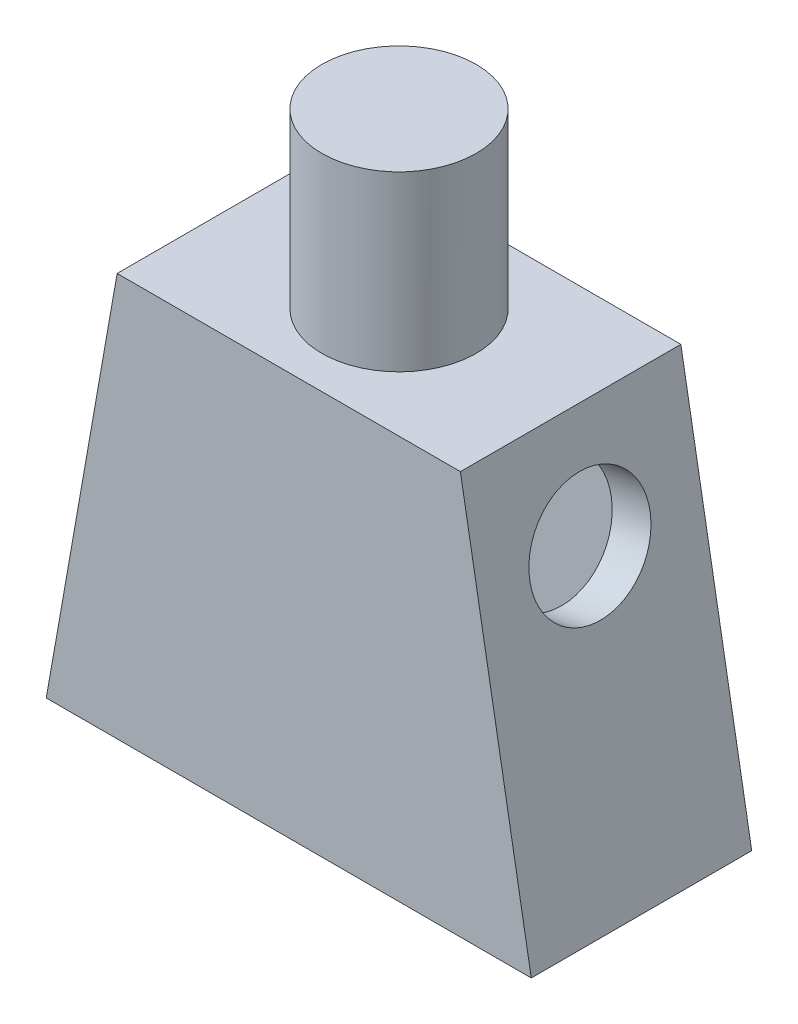
ISO-10303-21;
HEADER;
FILE_DESCRIPTION(('STEP AP214'),'2;1');
FILE_NAME('part.step','',(''),(''),'','','');
FILE_SCHEMA(('AUTOMOTIVE_DESIGN { 1 0 10303 214 1 1 1 1 }'));
ENDSEC;
DATA;
#1=APPLICATION_CONTEXT('core data for automotive mechanical design processes');
#2=APPLICATION_PROTOCOL_DEFINITION('international standard','automotive_design',2000,#1);
#3=PRODUCT_CONTEXT('',#1,'mechanical');
#4=PRODUCT('Part','Part','',(#3));
#5=PRODUCT_RELATED_PRODUCT_CATEGORY('part','',(#4));
#6=PRODUCT_DEFINITION_FORMATION('','',#4);
#7=PRODUCT_DEFINITION_CONTEXT('part definition',#1,'design');
#8=PRODUCT_DEFINITION('design','',#6,#7);
#9=PRODUCT_DEFINITION_SHAPE('','',#8);
#10=(LENGTH_UNIT() NAMED_UNIT(*) SI_UNIT(.MILLI.,.METRE.));
#11=(NAMED_UNIT(*) PLANE_ANGLE_UNIT() SI_UNIT($,.RADIAN.));
#12=(NAMED_UNIT(*) SI_UNIT($,.STERADIAN.) SOLID_ANGLE_UNIT());
#13=UNCERTAINTY_MEASURE_WITH_UNIT(LENGTH_MEASURE(1.E-05),#10,'distance_accuracy_value','');
#14=(GEOMETRIC_REPRESENTATION_CONTEXT(3) GLOBAL_UNCERTAINTY_ASSIGNED_CONTEXT((#13)) GLOBAL_UNIT_ASSIGNED_CONTEXT((#10,
#11,#12)) REPRESENTATION_CONTEXT('',''));
#15=CARTESIAN_POINT('',(0.,0.,0.));
#16=DIRECTION('',(0.,0.,1.));
#17=DIRECTION('',(1.,0.,0.));
#18=AXIS2_PLACEMENT_3D('',#15,#16,#17);
#19=CARTESIAN_POINT('',(5.45,6.4,7.));
#20=DIRECTION('',(0.,-1.,0.));
#21=DIRECTION('',(0.,0.,-1.));
#22=AXIS2_PLACEMENT_3D('',#19,#20,#21);
#23=PLANE('',#22);
#24=DIRECTION('',(-1.,0.,0.));
#25=VECTOR('',#24,1.);
#26=CARTESIAN_POINT('',(5.45,6.4,0.));
#27=LINE('',#26,#25);
#28=CARTESIAN_POINT('',(5.45,6.4,0.));
#29=VERTEX_POINT('',#28);
#30=CARTESIAN_POINT('',(-5.45,6.4,0.));
#31=VERTEX_POINT('',#30);
#32=EDGE_CURVE('E153',#29,#31,#27,.T.);
#33=ORIENTED_EDGE('',*,*,#32,.T.);
#34=DIRECTION('',(0.,0.,-1.));
#35=VECTOR('',#34,1.);
#36=CARTESIAN_POINT('',(-5.45,6.4,7.));
#37=LINE('',#36,#35);
#38=CARTESIAN_POINT('',(-5.45,6.4,7.));
#39=VERTEX_POINT('',#38);
#40=EDGE_CURVE('E161',#39,#31,#37,.T.);
#41=ORIENTED_EDGE('',*,*,#40,.F.);
#42=DIRECTION('',(-1.,0.,0.));
#43=VECTOR('',#42,1.);
#44=CARTESIAN_POINT('',(5.45,6.4,7.));
#45=LINE('',#44,#43);
#46=CARTESIAN_POINT('',(5.45,6.4,7.));
#47=VERTEX_POINT('',#46);
#48=EDGE_CURVE('E84',#47,#39,#45,.T.);
#49=ORIENTED_EDGE('',*,*,#48,.F.);
#50=DIRECTION('',(0.,0.,-1.));
#51=VECTOR('',#50,1.);
#52=CARTESIAN_POINT('',(5.45,6.4,7.));
#53=LINE('',#52,#51);
#54=EDGE_CURVE('E39',#47,#29,#53,.T.);
#55=ORIENTED_EDGE('',*,*,#54,.T.);
#56=EDGE_LOOP('',(#33,#41,#49,#55));
#57=FACE_BOUND('',#56,.T.);
#58=CARTESIAN_POINT('',(0.,6.4,3.5));
#59=DIRECTION('',(0.,-1.,0.));
#60=DIRECTION('',(0.,0.,-1.));
#61=AXIS2_PLACEMENT_3D('',#58,#59,#60);
#62=CIRCLE('',#61,2.45);
#63=CARTESIAN_POINT('',(0.,6.4,1.05));
#64=VERTEX_POINT('',#63);
#65=EDGE_CURVE('E11',#64,#64,#62,.F.);
#66=ORIENTED_EDGE('',*,*,#65,.F.);
#67=EDGE_LOOP('',(#66));
#68=FACE_BOUND('',#67,.T.);
#69=ADVANCED_FACE('F31',(#57,#68),#23,.F.);
#70=CARTESIAN_POINT('',(-7.7,-6.4,7.));
#71=DIRECTION('',(0.,1.,0.));
#72=DIRECTION('',(0.,0.,1.));
#73=AXIS2_PLACEMENT_3D('',#70,#71,#72);
#74=PLANE('',#73);
#75=DIRECTION('',(1.,0.,0.));
#76=VECTOR('',#75,1.);
#77=CARTESIAN_POINT('',(-7.7,-6.4,0.));
#78=LINE('',#77,#76);
#79=CARTESIAN_POINT('',(-7.7,-6.4,0.));
#80=VERTEX_POINT('',#79);
#81=CARTESIAN_POINT('',(7.7,-6.4,0.));
#82=VERTEX_POINT('',#81);
#83=EDGE_CURVE('E76',#80,#82,#78,.T.);
#84=ORIENTED_EDGE('',*,*,#83,.T.);
#85=DIRECTION('',(0.,0.,-1.));
#86=VECTOR('',#85,1.);
#87=CARTESIAN_POINT('',(7.7,-6.4,7.));
#88=LINE('',#87,#86);
#89=CARTESIAN_POINT('',(7.7,-6.4,7.));
#90=VERTEX_POINT('',#89);
#91=EDGE_CURVE('E149',#90,#82,#88,.T.);
#92=ORIENTED_EDGE('',*,*,#91,.F.);
#93=DIRECTION('',(1.,0.,0.));
#94=VECTOR('',#93,1.);
#95=CARTESIAN_POINT('',(-7.7,-6.4,7.));
#96=LINE('',#95,#94);
#97=CARTESIAN_POINT('',(-7.7,-6.4,7.));
#98=VERTEX_POINT('',#97);
#99=EDGE_CURVE('E55',#98,#90,#96,.T.);
#100=ORIENTED_EDGE('',*,*,#99,.F.);
#101=DIRECTION('',(0.,0.,-1.));
#102=VECTOR('',#101,1.);
#103=CARTESIAN_POINT('',(-7.7,-6.4,7.));
#104=LINE('',#103,#102);
#105=EDGE_CURVE('E159',#98,#80,#104,.T.);
#106=ORIENTED_EDGE('',*,*,#105,.T.);
#107=EDGE_LOOP('',(#84,#92,#100,#106));
#108=FACE_BOUND('',#107,.T.);
#109=DIRECTION('',(1.,0.,0.));
#110=VECTOR('',#109,1.);
#111=CARTESIAN_POINT('',(-7.7,-6.4,1.25));
#112=LINE('',#111,#110);
#113=CARTESIAN_POINT('',(-6.43083501377162,-6.4,1.25));
#114=VERTEX_POINT('',#113);
#115=CARTESIAN_POINT('',(6.43083501377163,-6.4,1.25));
#116=VERTEX_POINT('',#115);
#117=EDGE_CURVE('E130',#114,#116,#112,.T.);
#118=ORIENTED_EDGE('',*,*,#117,.F.);
#119=DIRECTION('',(0.,0.,-1.));
#120=VECTOR('',#119,1.);
#121=CARTESIAN_POINT('',(-6.43083501377162,-6.4,7.));
#122=LINE('',#121,#120);
#123=CARTESIAN_POINT('',(-6.43083501377162,-6.4,5.75));
#124=VERTEX_POINT('',#123);
#125=EDGE_CURVE('E125',#124,#114,#122,.T.);
#126=ORIENTED_EDGE('',*,*,#125,.F.);
#127=DIRECTION('',(1.,0.,0.));
#128=VECTOR('',#127,1.);
#129=CARTESIAN_POINT('',(-7.7,-6.4,5.75));
#130=LINE('',#129,#128);
#131=CARTESIAN_POINT('',(6.43083501377163,-6.4,5.75));
#132=VERTEX_POINT('',#131);
#133=EDGE_CURVE('E46',#124,#132,#130,.T.);
#134=ORIENTED_EDGE('',*,*,#133,.T.);
#135=DIRECTION('',(0.,0.,-1.));
#136=VECTOR('',#135,1.);
#137=CARTESIAN_POINT('',(6.43083501377163,-6.4,7.));
#138=LINE('',#137,#136);
#139=EDGE_CURVE('E138',#132,#116,#138,.T.);
#140=ORIENTED_EDGE('',*,*,#139,.T.);
#141=EDGE_LOOP('',(#118,#126,#134,#140));
#142=FACE_BOUND('',#141,.T.);
#143=ADVANCED_FACE('F175',(#108,#142),#74,.F.);
#144=CARTESIAN_POINT('',(7.7,-6.4,7.));
#145=DIRECTION('',(-0.984899531237994,-0.173126870725429,0.));
#146=DIRECTION('',(0.173126870725429,-0.984899531237994,0.));
#147=AXIS2_PLACEMENT_3D('',#144,#145,#146);
#148=PLANE('',#147);
#149=CARTESIAN_POINT('',(6.06286912236802,2.9134556594175,3.5));
#150=DIRECTION('',(0.984899531237994,0.173126870725429,0.));
#151=DIRECTION('',(-0.173126870725429,0.984899531237994,0.));
#152=AXIS2_PLACEMENT_3D('',#149,#150,#151);
#153=CIRCLE('',#152,1.91);
#154=CARTESIAN_POINT('',(5.73219679928245,4.79461376408207,3.5));
#155=VERTEX_POINT('',#154);
#156=EDGE_CURVE('E202',#155,#155,#153,.T.);
#157=ORIENTED_EDGE('',*,*,#156,.F.);
#158=EDGE_LOOP('',(#157));
#159=FACE_BOUND('',#158,.T.);
#160=DIRECTION('',(-0.173126870725429,0.984899531237994,0.));
#161=VECTOR('',#160,1.);
#162=CARTESIAN_POINT('',(7.7,-6.4,0.));
#163=LINE('',#162,#161);
#164=EDGE_CURVE('E150',#82,#29,#163,.T.);
#165=ORIENTED_EDGE('',*,*,#164,.T.);
#166=ORIENTED_EDGE('',*,*,#54,.F.);
#167=DIRECTION('',(-0.173126870725429,0.984899531237994,0.));
#168=VECTOR('',#167,1.);
#169=CARTESIAN_POINT('',(7.7,-6.4,7.));
#170=LINE('',#169,#168);
#171=EDGE_CURVE('E143',#90,#47,#170,.T.);
#172=ORIENTED_EDGE('',*,*,#171,.F.);
#173=ORIENTED_EDGE('',*,*,#91,.T.);
#174=EDGE_LOOP('',(#165,#166,#172,#173));
#175=FACE_BOUND('',#174,.T.);
#176=ADVANCED_FACE('F33',(#159,#175),#148,.F.);
#177=CARTESIAN_POINT('',(-5.45,6.4,7.));
#178=DIRECTION('',(0.984899531237994,-0.173126870725428,0.));
#179=DIRECTION('',(0.173126870725428,0.984899531237994,0.));
#180=AXIS2_PLACEMENT_3D('',#177,#178,#179);
#181=PLANE('',#180);
#182=CARTESIAN_POINT('',(-6.06286912236802,2.9134556594175,3.5));
#183=DIRECTION('',(-0.984899531237994,0.173126870725428,0.));
#184=DIRECTION('',(-0.173126870725428,-0.984899531237994,0.));
#185=AXIS2_PLACEMENT_3D('',#182,#183,#184);
#186=CIRCLE('',#185,1.91);
#187=CARTESIAN_POINT('',(-6.39354144545358,1.03229755475293,3.5));
#188=VERTEX_POINT('',#187);
#189=EDGE_CURVE('E208',#188,#188,#186,.T.);
#190=ORIENTED_EDGE('',*,*,#189,.F.);
#191=EDGE_LOOP('',(#190));
#192=FACE_BOUND('',#191,.T.);
#193=DIRECTION('',(-0.173126870725428,-0.984899531237994,0.));
#194=VECTOR('',#193,1.);
#195=CARTESIAN_POINT('',(-5.45,6.4,0.));
#196=LINE('',#195,#194);
#197=EDGE_CURVE('E155',#31,#80,#196,.T.);
#198=ORIENTED_EDGE('',*,*,#197,.T.);
#199=ORIENTED_EDGE('',*,*,#105,.F.);
#200=DIRECTION('',(-0.173126870725428,-0.984899531237994,0.));
#201=VECTOR('',#200,1.);
#202=CARTESIAN_POINT('',(-5.45,6.4,7.));
#203=LINE('',#202,#201);
#204=EDGE_CURVE('E146',#39,#98,#203,.T.);
#205=ORIENTED_EDGE('',*,*,#204,.F.);
#206=ORIENTED_EDGE('',*,*,#40,.T.);
#207=EDGE_LOOP('',(#198,#199,#205,#206));
#208=FACE_BOUND('',#207,.T.);
#209=ADVANCED_FACE('F173',(#192,#208),#181,.F.);
#210=CARTESIAN_POINT('',(5.45,6.4,7.));
#211=DIRECTION('',(0.,0.,1.));
#212=DIRECTION('',(1.,0.,0.));
#213=AXIS2_PLACEMENT_3D('',#210,#211,#212);
#214=PLANE('',#213);
#215=ORIENTED_EDGE('',*,*,#171,.T.);
#216=ORIENTED_EDGE('',*,*,#48,.T.);
#217=ORIENTED_EDGE('',*,*,#204,.T.);
#218=ORIENTED_EDGE('',*,*,#99,.T.);
#219=EDGE_LOOP('',(#215,#216,#217,#218));
#220=FACE_BOUND('',#219,.T.);
#221=ADVANCED_FACE('F177',(#220),#214,.T.);
#222=CARTESIAN_POINT('',(5.45,6.4,0.));
#223=DIRECTION('',(0.,0.,1.));
#224=DIRECTION('',(1.,0.,0.));
#225=AXIS2_PLACEMENT_3D('',#222,#223,#224);
#226=PLANE('',#225);
#227=ORIENTED_EDGE('',*,*,#164,.F.);
#228=ORIENTED_EDGE('',*,*,#83,.F.);
#229=ORIENTED_EDGE('',*,*,#197,.F.);
#230=ORIENTED_EDGE('',*,*,#32,.F.);
#231=EDGE_LOOP('',(#227,#228,#229,#230));
#232=FACE_BOUND('',#231,.T.);
#233=ADVANCED_FACE('F169',(#232),#226,.F.);
#234=CARTESIAN_POINT('',(6.46887558595251,-6.61640858840679,7.));
#235=DIRECTION('',(-0.984899531237994,-0.173126870725429,0.));
#236=DIRECTION('',(0.173126870725429,-0.984899531237994,0.));
#237=AXIS2_PLACEMENT_3D('',#234,#235,#236);
#238=PLANE('',#237);
#239=CARTESIAN_POINT('',(4.83174470832053,2.69704707101071,3.5));
#240=DIRECTION('',(-0.984899531237994,-0.173126870725429,0.));
#241=DIRECTION('',(0.173126870725429,-0.984899531237994,0.));
#242=AXIS2_PLACEMENT_3D('',#239,#240,#241);
#243=CIRCLE('',#242,1.91);
#244=CARTESIAN_POINT('',(5.1624170314061,0.815888966346144,3.5));
#245=VERTEX_POINT('',#244);
#246=EDGE_CURVE('E205',#245,#245,#243,.F.);
#247=ORIENTED_EDGE('',*,*,#246,.T.);
#248=EDGE_LOOP('',(#247));
#249=FACE_BOUND('',#248,.T.);
#250=DIRECTION('',(-0.173126870725429,0.984899531237994,0.));
#251=VECTOR('',#250,1.);
#252=CARTESIAN_POINT('',(6.46887558595251,-6.61640858840679,1.25));
#253=LINE('',#252,#251);
#254=CARTESIAN_POINT('',(4.40056157627163,5.15,1.25));
#255=VERTEX_POINT('',#254);
#256=EDGE_CURVE('E114',#116,#255,#253,.T.);
#257=ORIENTED_EDGE('',*,*,#256,.F.);
#258=ORIENTED_EDGE('',*,*,#139,.F.);
#259=DIRECTION('',(-0.173126870725429,0.984899531237994,0.));
#260=VECTOR('',#259,1.);
#261=CARTESIAN_POINT('',(6.46887558595251,-6.61640858840679,5.75));
#262=LINE('',#261,#260);
#263=CARTESIAN_POINT('',(4.40056157627163,5.15,5.75));
#264=VERTEX_POINT('',#263);
#265=EDGE_CURVE('E132',#132,#264,#262,.T.);
#266=ORIENTED_EDGE('',*,*,#265,.T.);
#267=DIRECTION('',(0.,0.,-1.));
#268=VECTOR('',#267,1.);
#269=CARTESIAN_POINT('',(4.40056157627163,5.15,7.));
#270=LINE('',#269,#268);
#271=EDGE_CURVE('E124',#264,#255,#270,.T.);
#272=ORIENTED_EDGE('',*,*,#271,.T.);
#273=EDGE_LOOP('',(#257,#258,#266,#272));
#274=FACE_BOUND('',#273,.T.);
#275=ADVANCED_FACE('F184',(#249,#274),#238,.T.);
#276=CARTESIAN_POINT('',(5.45,5.15,7.));
#277=DIRECTION('',(0.,-1.,0.));
#278=DIRECTION('',(0.,0.,-1.));
#279=AXIS2_PLACEMENT_3D('',#276,#277,#278);
#280=PLANE('',#279);
#281=DIRECTION('',(-1.,0.,0.));
#282=VECTOR('',#281,1.);
#283=CARTESIAN_POINT('',(5.45,5.15,1.25));
#284=LINE('',#283,#282);
#285=CARTESIAN_POINT('',(-4.40056157627163,5.15,1.25));
#286=VERTEX_POINT('',#285);
#287=EDGE_CURVE('E107',#255,#286,#284,.T.);
#288=ORIENTED_EDGE('',*,*,#287,.F.);
#289=ORIENTED_EDGE('',*,*,#271,.F.);
#290=DIRECTION('',(-1.,0.,0.));
#291=VECTOR('',#290,1.);
#292=CARTESIAN_POINT('',(5.45,5.15,5.75));
#293=LINE('',#292,#291);
#294=CARTESIAN_POINT('',(-4.40056157627163,5.15,5.75));
#295=VERTEX_POINT('',#294);
#296=EDGE_CURVE('E122',#264,#295,#293,.T.);
#297=ORIENTED_EDGE('',*,*,#296,.T.);
#298=DIRECTION('',(0.,0.,-1.));
#299=VECTOR('',#298,1.);
#300=CARTESIAN_POINT('',(-4.40056157627163,5.15,7.));
#301=LINE('',#300,#299);
#302=EDGE_CURVE('E120',#295,#286,#301,.T.);
#303=ORIENTED_EDGE('',*,*,#302,.T.);
#304=EDGE_LOOP('',(#288,#289,#297,#303));
#305=FACE_BOUND('',#304,.T.);
#306=ADVANCED_FACE('F121',(#305),#280,.T.);
#307=CARTESIAN_POINT('',(-4.21887558595251,6.18359141159321,7.));
#308=DIRECTION('',(0.984899531237994,-0.173126870725428,0.));
#309=DIRECTION('',(0.173126870725428,0.984899531237994,0.));
#310=AXIS2_PLACEMENT_3D('',#307,#308,#309);
#311=PLANE('',#310);
#312=CARTESIAN_POINT('',(-4.83174470832052,2.69704707101071,3.5));
#313=DIRECTION('',(0.984899531237994,-0.173126870725428,0.));
#314=DIRECTION('',(0.173126870725428,0.984899531237994,0.));
#315=AXIS2_PLACEMENT_3D('',#312,#313,#314);
#316=CIRCLE('',#315,1.91);
#317=CARTESIAN_POINT('',(-4.50107238523496,4.57820517567528,3.5));
#318=VERTEX_POINT('',#317);
#319=EDGE_CURVE('E204',#318,#318,#316,.F.);
#320=ORIENTED_EDGE('',*,*,#319,.T.);
#321=EDGE_LOOP('',(#320));
#322=FACE_BOUND('',#321,.T.);
#323=DIRECTION('',(-0.173126870725428,-0.984899531237994,0.));
#324=VECTOR('',#323,1.);
#325=CARTESIAN_POINT('',(-4.21887558595251,6.18359141159321,1.25));
#326=LINE('',#325,#324);
#327=EDGE_CURVE('E111',#286,#114,#326,.T.);
#328=ORIENTED_EDGE('',*,*,#327,.F.);
#329=ORIENTED_EDGE('',*,*,#302,.F.);
#330=DIRECTION('',(-0.173126870725428,-0.984899531237994,0.));
#331=VECTOR('',#330,1.);
#332=CARTESIAN_POINT('',(-4.21887558595251,6.18359141159321,5.75));
#333=LINE('',#332,#331);
#334=EDGE_CURVE('E136',#295,#124,#333,.T.);
#335=ORIENTED_EDGE('',*,*,#334,.T.);
#336=ORIENTED_EDGE('',*,*,#125,.T.);
#337=EDGE_LOOP('',(#328,#329,#335,#336));
#338=FACE_BOUND('',#337,.T.);
#339=ADVANCED_FACE('F127',(#322,#338),#311,.T.);
#340=CARTESIAN_POINT('',(5.45,6.4,5.75));
#341=DIRECTION('',(0.,0.,1.));
#342=DIRECTION('',(1.,0.,0.));
#343=AXIS2_PLACEMENT_3D('',#340,#341,#342);
#344=PLANE('',#343);
#345=ORIENTED_EDGE('',*,*,#265,.F.);
#346=ORIENTED_EDGE('',*,*,#133,.F.);
#347=ORIENTED_EDGE('',*,*,#334,.F.);
#348=ORIENTED_EDGE('',*,*,#296,.F.);
#349=EDGE_LOOP('',(#345,#346,#347,#348));
#350=FACE_BOUND('',#349,.T.);
#351=ADVANCED_FACE('F222',(#350),#344,.F.);
#352=CARTESIAN_POINT('',(5.45,6.4,1.25));
#353=DIRECTION('',(0.,0.,1.));
#354=DIRECTION('',(1.,0.,0.));
#355=AXIS2_PLACEMENT_3D('',#352,#353,#354);
#356=PLANE('',#355);
#357=ORIENTED_EDGE('',*,*,#256,.T.);
#358=ORIENTED_EDGE('',*,*,#287,.T.);
#359=ORIENTED_EDGE('',*,*,#327,.T.);
#360=ORIENTED_EDGE('',*,*,#117,.T.);
#361=EDGE_LOOP('',(#357,#358,#359,#360));
#362=FACE_BOUND('',#361,.T.);
#363=ADVANCED_FACE('F109',(#362),#356,.T.);
#364=CARTESIAN_POINT('',(0.,11.9,3.5));
#365=DIRECTION('',(0.,-1.,0.));
#366=DIRECTION('',(0.,0.,-1.));
#367=AXIS2_PLACEMENT_3D('',#364,#365,#366);
#368=CYLINDRICAL_SURFACE('',#367,2.45);
#369=CARTESIAN_POINT('',(0.,11.9,3.5));
#370=DIRECTION('',(0.,1.,0.));
#371=DIRECTION('',(0.,0.,1.));
#372=AXIS2_PLACEMENT_3D('',#369,#370,#371);
#373=CIRCLE('',#372,2.45);
#374=CARTESIAN_POINT('',(0.,11.9,5.95));
#375=VERTEX_POINT('',#374);
#376=EDGE_CURVE('E214',#375,#375,#373,.T.);
#377=ORIENTED_EDGE('',*,*,#376,.F.);
#378=EDGE_LOOP('',(#377));
#379=FACE_BOUND('',#378,.T.);
#380=ORIENTED_EDGE('',*,*,#65,.T.);
#381=EDGE_LOOP('',(#380));
#382=FACE_BOUND('',#381,.T.);
#383=ADVANCED_FACE('F229',(#379,#382),#368,.T.);
#384=CARTESIAN_POINT('',(0.,11.9,3.5));
#385=DIRECTION('',(0.,1.,0.));
#386=DIRECTION('',(0.,0.,1.));
#387=AXIS2_PLACEMENT_3D('',#384,#385,#386);
#388=PLANE('',#387);
#389=ORIENTED_EDGE('',*,*,#376,.T.);
#390=EDGE_LOOP('',(#389));
#391=FACE_BOUND('',#390,.T.);
#392=ADVANCED_FACE('F240',(#391),#388,.T.);
#393=CARTESIAN_POINT('',(8.87668855143788,0.287361537068811,3.5));
#394=DIRECTION('',(-0.984899531237994,0.173126870725428,0.));
#395=DIRECTION('',(-0.173126870725428,-0.984899531237994,0.));
#396=AXIS2_PLACEMENT_3D('',#393,#394,#395);
#397=CYLINDRICAL_SURFACE('',#396,1.91);
#398=ORIENTED_EDGE('',*,*,#319,.F.);
#399=EDGE_LOOP('',(#398));
#400=FACE_BOUND('',#399,.T.);
#401=ORIENTED_EDGE('',*,*,#189,.T.);
#402=EDGE_LOOP('',(#401));
#403=FACE_BOUND('',#402,.T.);
#404=ADVANCED_FACE('F244',(#400,#403),#397,.F.);
#405=CARTESIAN_POINT('',(-8.87668855143788,0.287361537068804,3.5));
#406=DIRECTION('',(0.984899531237994,0.173126870725429,0.));
#407=DIRECTION('',(-0.173126870725429,0.984899531237994,0.));
#408=AXIS2_PLACEMENT_3D('',#405,#406,#407);
#409=CYLINDRICAL_SURFACE('',#408,1.91);
#410=ORIENTED_EDGE('',*,*,#246,.F.);
#411=EDGE_LOOP('',(#410));
#412=FACE_BOUND('',#411,.T.);
#413=ORIENTED_EDGE('',*,*,#156,.T.);
#414=EDGE_LOOP('',(#413));
#415=FACE_BOUND('',#414,.T.);
#416=ADVANCED_FACE('F248',(#412,#415),#409,.F.);
#417=CLOSED_SHELL('',(#69,#143,#176,#209,#221,#233,#275,#306,#339,#351,#363,#383,#392,#404,#416));
#418=MANIFOLD_SOLID_BREP('B2',#417);
#419=ADVANCED_BREP_SHAPE_REPRESENTATION('',(#18,#418),#14);
#420=SHAPE_DEFINITION_REPRESENTATION(#9,#419);
ENDSEC;
END-ISO-10303-21;
